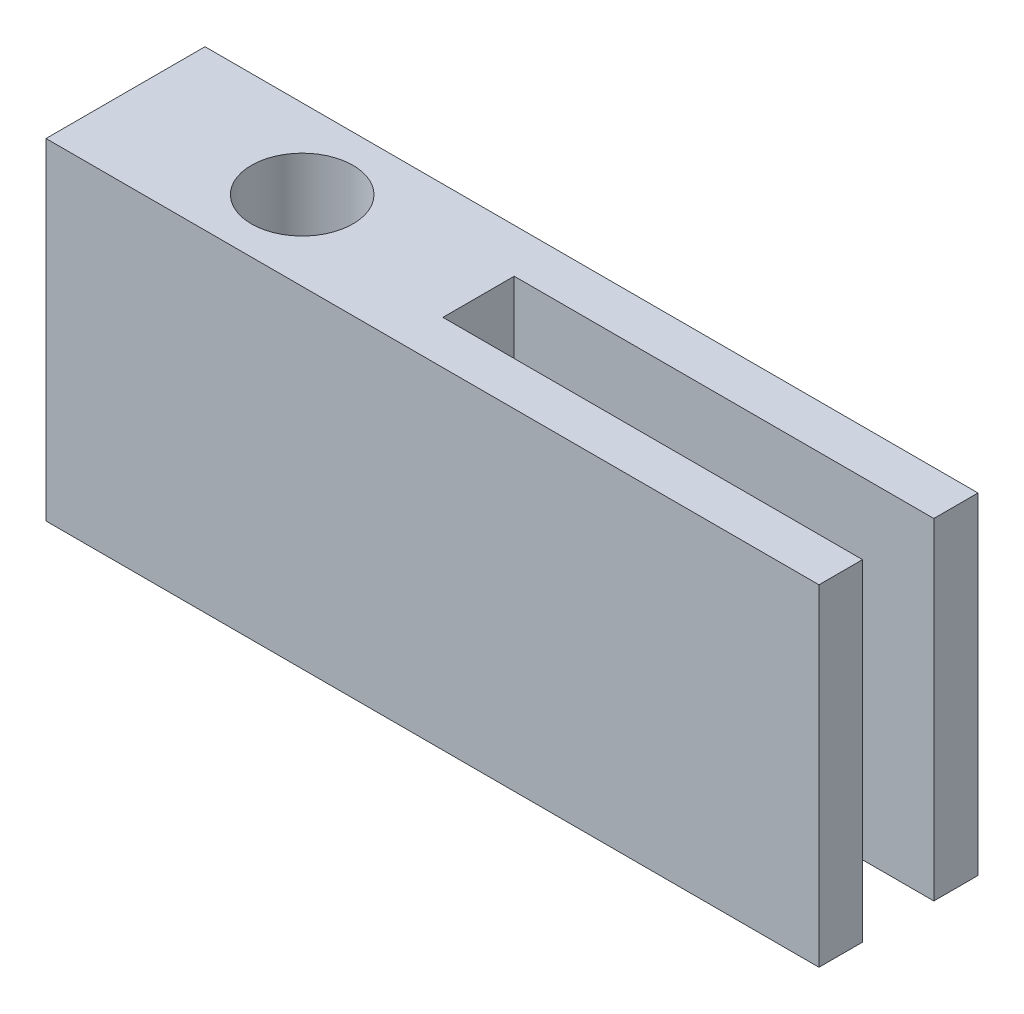
ISO-10303-21;
HEADER;
FILE_DESCRIPTION(('STEP AP214'),'2;1');
FILE_NAME('part.step','',(''),(''),'','','');
FILE_SCHEMA(('AUTOMOTIVE_DESIGN { 1 0 10303 214 1 1 1 1 }'));
ENDSEC;
DATA;
#1=APPLICATION_CONTEXT('core data for automotive mechanical design processes');
#2=APPLICATION_PROTOCOL_DEFINITION('international standard','automotive_design',2000,#1);
#3=PRODUCT_CONTEXT('',#1,'mechanical');
#4=PRODUCT('Part','Part','',(#3));
#5=PRODUCT_RELATED_PRODUCT_CATEGORY('part','',(#4));
#6=PRODUCT_DEFINITION_FORMATION('','',#4);
#7=PRODUCT_DEFINITION_CONTEXT('part definition',#1,'design');
#8=PRODUCT_DEFINITION('design','',#6,#7);
#9=PRODUCT_DEFINITION_SHAPE('','',#8);
#10=(LENGTH_UNIT() NAMED_UNIT(*) SI_UNIT(.MILLI.,.METRE.));
#11=(NAMED_UNIT(*) PLANE_ANGLE_UNIT() SI_UNIT($,.RADIAN.));
#12=(NAMED_UNIT(*) SI_UNIT($,.STERADIAN.) SOLID_ANGLE_UNIT());
#13=UNCERTAINTY_MEASURE_WITH_UNIT(LENGTH_MEASURE(1.E-05),#10,'distance_accuracy_value','');
#14=(GEOMETRIC_REPRESENTATION_CONTEXT(3) GLOBAL_UNCERTAINTY_ASSIGNED_CONTEXT((#13)) GLOBAL_UNIT_ASSIGNED_CONTEXT((#10,
#11,#12)) REPRESENTATION_CONTEXT('',''));
#15=CARTESIAN_POINT('',(0.,0.,0.));
#16=DIRECTION('',(0.,0.,1.));
#17=DIRECTION('',(1.,0.,0.));
#18=AXIS2_PLACEMENT_3D('',#15,#16,#17);
#19=CARTESIAN_POINT('',(0.,7.5,0.));
#20=DIRECTION('',(0.,-1.,0.));
#21=DIRECTION('',(0.,0.,-1.));
#22=AXIS2_PLACEMENT_3D('',#19,#20,#21);
#23=PLANE('',#22);
#24=DIRECTION('',(0.,0.,-1.));
#25=VECTOR('',#24,1.);
#26=CARTESIAN_POINT('',(17.5,7.5,-0.986331657312897));
#27=LINE('',#26,#25);
#28=CARTESIAN_POINT('',(17.5,7.5,0.));
#29=VERTEX_POINT('',#28);
#30=CARTESIAN_POINT('',(17.5,7.5,-0.986331657312897));
#31=VERTEX_POINT('',#30);
#32=EDGE_CURVE('E147',#29,#31,#27,.T.);
#33=ORIENTED_EDGE('',*,*,#32,.T.);
#34=DIRECTION('',(-1.,0.,0.));
#35=VECTOR('',#34,1.);
#36=CARTESIAN_POINT('',(17.5,7.5,-0.986331657312897));
#37=LINE('',#36,#35);
#38=CARTESIAN_POINT('',(8.,7.5,-0.986331657312896));
#39=VERTEX_POINT('',#38);
#40=EDGE_CURVE('E95',#31,#39,#37,.T.);
#41=ORIENTED_EDGE('',*,*,#40,.T.);
#42=DIRECTION('',(0.,0.,-1.));
#43=VECTOR('',#42,1.);
#44=CARTESIAN_POINT('',(8.,7.5,-2.6));
#45=LINE('',#44,#43);
#46=CARTESIAN_POINT('',(8.,7.5,-2.6));
#47=VERTEX_POINT('',#46);
#48=EDGE_CURVE('E162',#39,#47,#45,.T.);
#49=ORIENTED_EDGE('',*,*,#48,.T.);
#50=DIRECTION('',(1.,0.,0.));
#51=VECTOR('',#50,1.);
#52=CARTESIAN_POINT('',(17.5,7.5,-2.6));
#53=LINE('',#52,#51);
#54=CARTESIAN_POINT('',(17.5,7.5,-2.6));
#55=VERTEX_POINT('',#54);
#56=EDGE_CURVE('E175',#47,#55,#53,.T.);
#57=ORIENTED_EDGE('',*,*,#56,.T.);
#58=DIRECTION('',(0.,0.,-1.));
#59=VECTOR('',#58,1.);
#60=CARTESIAN_POINT('',(17.5,7.5,-3.6));
#61=LINE('',#60,#59);
#62=CARTESIAN_POINT('',(17.5,7.5,-3.6));
#63=VERTEX_POINT('',#62);
#64=EDGE_CURVE('E114',#55,#63,#61,.T.);
#65=ORIENTED_EDGE('',*,*,#64,.T.);
#66=DIRECTION('',(-1.,0.,0.));
#67=VECTOR('',#66,1.);
#68=CARTESIAN_POINT('',(17.5,7.5,-3.6));
#69=LINE('',#68,#67);
#70=CARTESIAN_POINT('',(0.,7.5,-3.6));
#71=VERTEX_POINT('',#70);
#72=EDGE_CURVE('E108',#63,#71,#69,.T.);
#73=ORIENTED_EDGE('',*,*,#72,.T.);
#74=DIRECTION('',(0.,0.,1.));
#75=VECTOR('',#74,1.);
#76=CARTESIAN_POINT('',(0.,7.5,-3.6));
#77=LINE('',#76,#75);
#78=CARTESIAN_POINT('',(0.,7.5,0.));
#79=VERTEX_POINT('',#78);
#80=EDGE_CURVE('E112',#71,#79,#77,.T.);
#81=ORIENTED_EDGE('',*,*,#80,.T.);
#82=DIRECTION('',(1.,0.,0.));
#83=VECTOR('',#82,1.);
#84=CARTESIAN_POINT('',(17.5,7.5,0.));
#85=LINE('',#84,#83);
#86=EDGE_CURVE('E52',#79,#29,#85,.T.);
#87=ORIENTED_EDGE('',*,*,#86,.T.);
#88=EDGE_LOOP('',(#33,#41,#49,#57,#65,#73,#81,#87));
#89=FACE_BOUND('',#88,.T.);
#90=CARTESIAN_POINT('',(4.,7.5,-1.8));
#91=DIRECTION('',(0.,1.,0.));
#92=DIRECTION('',(0.,0.,1.));
#93=AXIS2_PLACEMENT_3D('',#90,#91,#92);
#94=CIRCLE('',#93,1.15);
#95=CARTESIAN_POINT('',(4.,7.5,-0.65));
#96=VERTEX_POINT('',#95);
#97=EDGE_CURVE('E136',#96,#96,#94,.T.);
#98=ORIENTED_EDGE('',*,*,#97,.F.);
#99=EDGE_LOOP('',(#98));
#100=FACE_BOUND('',#99,.T.);
#101=ADVANCED_FACE('F35',(#89,#100),#23,.F.);
#102=CARTESIAN_POINT('',(0.,0.,0.));
#103=DIRECTION('',(0.,-1.,0.));
#104=DIRECTION('',(0.,0.,-1.));
#105=AXIS2_PLACEMENT_3D('',#102,#103,#104);
#106=PLANE('',#105);
#107=DIRECTION('',(0.,0.,-1.));
#108=VECTOR('',#107,1.);
#109=CARTESIAN_POINT('',(17.5,0.,-0.986331657312897));
#110=LINE('',#109,#108);
#111=CARTESIAN_POINT('',(17.5,0.,0.));
#112=VERTEX_POINT('',#111);
#113=CARTESIAN_POINT('',(17.5,0.,-0.986331657312897));
#114=VERTEX_POINT('',#113);
#115=EDGE_CURVE('E132',#112,#114,#110,.T.);
#116=ORIENTED_EDGE('',*,*,#115,.F.);
#117=DIRECTION('',(1.,0.,0.));
#118=VECTOR('',#117,1.);
#119=CARTESIAN_POINT('',(17.5,0.,0.));
#120=LINE('',#119,#118);
#121=CARTESIAN_POINT('',(0.,0.,0.));
#122=VERTEX_POINT('',#121);
#123=EDGE_CURVE('E87',#122,#112,#120,.T.);
#124=ORIENTED_EDGE('',*,*,#123,.F.);
#125=DIRECTION('',(0.,0.,1.));
#126=VECTOR('',#125,1.);
#127=CARTESIAN_POINT('',(0.,0.,-3.6));
#128=LINE('',#127,#126);
#129=CARTESIAN_POINT('',(0.,0.,-3.6));
#130=VERTEX_POINT('',#129);
#131=EDGE_CURVE('E81',#130,#122,#128,.T.);
#132=ORIENTED_EDGE('',*,*,#131,.F.);
#133=DIRECTION('',(-1.,0.,0.));
#134=VECTOR('',#133,1.);
#135=CARTESIAN_POINT('',(17.5,0.,-3.6));
#136=LINE('',#135,#134);
#137=CARTESIAN_POINT('',(17.5,0.,-3.6));
#138=VERTEX_POINT('',#137);
#139=EDGE_CURVE('E122',#138,#130,#136,.T.);
#140=ORIENTED_EDGE('',*,*,#139,.F.);
#141=DIRECTION('',(0.,0.,-1.));
#142=VECTOR('',#141,1.);
#143=CARTESIAN_POINT('',(17.5,0.,-3.6));
#144=LINE('',#143,#142);
#145=CARTESIAN_POINT('',(17.5,0.,-2.6));
#146=VERTEX_POINT('',#145);
#147=EDGE_CURVE('E142',#146,#138,#144,.T.);
#148=ORIENTED_EDGE('',*,*,#147,.F.);
#149=DIRECTION('',(1.,0.,0.));
#150=VECTOR('',#149,1.);
#151=CARTESIAN_POINT('',(17.5,0.,-2.6));
#152=LINE('',#151,#150);
#153=CARTESIAN_POINT('',(8.,0.,-2.6));
#154=VERTEX_POINT('',#153);
#155=EDGE_CURVE('E140',#154,#146,#152,.T.);
#156=ORIENTED_EDGE('',*,*,#155,.F.);
#157=DIRECTION('',(0.,0.,-1.));
#158=VECTOR('',#157,1.);
#159=CARTESIAN_POINT('',(8.,0.,-2.6));
#160=LINE('',#159,#158);
#161=CARTESIAN_POINT('',(8.,0.,-0.986331657312896));
#162=VERTEX_POINT('',#161);
#163=EDGE_CURVE('E138',#162,#154,#160,.T.);
#164=ORIENTED_EDGE('',*,*,#163,.F.);
#165=DIRECTION('',(-1.,0.,0.));
#166=VECTOR('',#165,1.);
#167=CARTESIAN_POINT('',(17.5,0.,-0.986331657312897));
#168=LINE('',#167,#166);
#169=EDGE_CURVE('E135',#114,#162,#168,.T.);
#170=ORIENTED_EDGE('',*,*,#169,.F.);
#171=EDGE_LOOP('',(#116,#124,#132,#140,#148,#156,#164,#170));
#172=FACE_BOUND('',#171,.T.);
#173=CARTESIAN_POINT('',(4.,0.,-1.8));
#174=DIRECTION('',(0.,1.,0.));
#175=DIRECTION('',(0.,0.,1.));
#176=AXIS2_PLACEMENT_3D('',#173,#174,#175);
#177=CIRCLE('',#176,1.15);
#178=CARTESIAN_POINT('',(4.,0.,-0.65));
#179=VERTEX_POINT('',#178);
#180=EDGE_CURVE('E181',#179,#179,#177,.T.);
#181=ORIENTED_EDGE('',*,*,#180,.T.);
#182=EDGE_LOOP('',(#181));
#183=FACE_BOUND('',#182,.T.);
#184=ADVANCED_FACE('F166',(#172,#183),#106,.T.);
#185=CARTESIAN_POINT('',(17.5,7.5,-0.986331657312897));
#186=DIRECTION('',(-1.,0.,0.));
#187=DIRECTION('',(0.,0.,1.));
#188=AXIS2_PLACEMENT_3D('',#185,#186,#187);
#189=PLANE('',#188);
#190=ORIENTED_EDGE('',*,*,#115,.T.);
#191=DIRECTION('',(0.,-1.,0.));
#192=VECTOR('',#191,1.);
#193=CARTESIAN_POINT('',(17.5,7.5,-0.986331657312897));
#194=LINE('',#193,#192);
#195=EDGE_CURVE('E11',#31,#114,#194,.T.);
#196=ORIENTED_EDGE('',*,*,#195,.F.);
#197=ORIENTED_EDGE('',*,*,#32,.F.);
#198=DIRECTION('',(0.,-1.,0.));
#199=VECTOR('',#198,1.);
#200=CARTESIAN_POINT('',(17.5,7.5,0.));
#201=LINE('',#200,#199);
#202=EDGE_CURVE('E128',#29,#112,#201,.T.);
#203=ORIENTED_EDGE('',*,*,#202,.T.);
#204=EDGE_LOOP('',(#190,#196,#197,#203));
#205=FACE_BOUND('',#204,.T.);
#206=ADVANCED_FACE('F37',(#205),#189,.F.);
#207=CARTESIAN_POINT('',(17.5,7.5,-0.986331657312897));
#208=DIRECTION('',(0.,0.,1.));
#209=DIRECTION('',(1.,0.,0.));
#210=AXIS2_PLACEMENT_3D('',#207,#208,#209);
#211=PLANE('',#210);
#212=ORIENTED_EDGE('',*,*,#169,.T.);
#213=DIRECTION('',(0.,-1.,0.));
#214=VECTOR('',#213,1.);
#215=CARTESIAN_POINT('',(8.,7.5,-0.986331657312896));
#216=LINE('',#215,#214);
#217=EDGE_CURVE('E44',#39,#162,#216,.T.);
#218=ORIENTED_EDGE('',*,*,#217,.F.);
#219=ORIENTED_EDGE('',*,*,#40,.F.);
#220=ORIENTED_EDGE('',*,*,#195,.T.);
#221=EDGE_LOOP('',(#212,#218,#219,#220));
#222=FACE_BOUND('',#221,.T.);
#223=ADVANCED_FACE('F209',(#222),#211,.F.);
#224=CARTESIAN_POINT('',(8.,7.5,-2.6));
#225=DIRECTION('',(-1.,0.,0.));
#226=DIRECTION('',(0.,0.,1.));
#227=AXIS2_PLACEMENT_3D('',#224,#225,#226);
#228=PLANE('',#227);
#229=ORIENTED_EDGE('',*,*,#163,.T.);
#230=DIRECTION('',(0.,-1.,0.));
#231=VECTOR('',#230,1.);
#232=CARTESIAN_POINT('',(8.,7.5,-2.6));
#233=LINE('',#232,#231);
#234=EDGE_CURVE('E154',#47,#154,#233,.T.);
#235=ORIENTED_EDGE('',*,*,#234,.F.);
#236=ORIENTED_EDGE('',*,*,#48,.F.);
#237=ORIENTED_EDGE('',*,*,#217,.T.);
#238=EDGE_LOOP('',(#229,#235,#236,#237));
#239=FACE_BOUND('',#238,.T.);
#240=ADVANCED_FACE('F160',(#239),#228,.F.);
#241=CARTESIAN_POINT('',(17.5,7.5,-2.6));
#242=DIRECTION('',(0.,0.,-1.));
#243=DIRECTION('',(-1.,0.,0.));
#244=AXIS2_PLACEMENT_3D('',#241,#242,#243);
#245=PLANE('',#244);
#246=ORIENTED_EDGE('',*,*,#155,.T.);
#247=DIRECTION('',(0.,-1.,0.));
#248=VECTOR('',#247,1.);
#249=CARTESIAN_POINT('',(17.5,7.5,-2.6));
#250=LINE('',#249,#248);
#251=EDGE_CURVE('E151',#55,#146,#250,.T.);
#252=ORIENTED_EDGE('',*,*,#251,.F.);
#253=ORIENTED_EDGE('',*,*,#56,.F.);
#254=ORIENTED_EDGE('',*,*,#234,.T.);
#255=EDGE_LOOP('',(#246,#252,#253,#254));
#256=FACE_BOUND('',#255,.T.);
#257=ADVANCED_FACE('F171',(#256),#245,.F.);
#258=CARTESIAN_POINT('',(17.5,7.5,-3.6));
#259=DIRECTION('',(-1.,0.,0.));
#260=DIRECTION('',(0.,0.,1.));
#261=AXIS2_PLACEMENT_3D('',#258,#259,#260);
#262=PLANE('',#261);
#263=ORIENTED_EDGE('',*,*,#147,.T.);
#264=DIRECTION('',(0.,-1.,0.));
#265=VECTOR('',#264,1.);
#266=CARTESIAN_POINT('',(17.5,7.5,-3.6));
#267=LINE('',#266,#265);
#268=EDGE_CURVE('E123',#63,#138,#267,.T.);
#269=ORIENTED_EDGE('',*,*,#268,.F.);
#270=ORIENTED_EDGE('',*,*,#64,.F.);
#271=ORIENTED_EDGE('',*,*,#251,.T.);
#272=EDGE_LOOP('',(#263,#269,#270,#271));
#273=FACE_BOUND('',#272,.T.);
#274=ADVANCED_FACE('F174',(#273),#262,.F.);
#275=CARTESIAN_POINT('',(17.5,7.5,-3.6));
#276=DIRECTION('',(0.,0.,1.));
#277=DIRECTION('',(1.,0.,0.));
#278=AXIS2_PLACEMENT_3D('',#275,#276,#277);
#279=PLANE('',#278);
#280=ORIENTED_EDGE('',*,*,#139,.T.);
#281=DIRECTION('',(0.,-1.,0.));
#282=VECTOR('',#281,1.);
#283=CARTESIAN_POINT('',(0.,7.5,-3.6));
#284=LINE('',#283,#282);
#285=EDGE_CURVE('E119',#71,#130,#284,.T.);
#286=ORIENTED_EDGE('',*,*,#285,.F.);
#287=ORIENTED_EDGE('',*,*,#72,.F.);
#288=ORIENTED_EDGE('',*,*,#268,.T.);
#289=EDGE_LOOP('',(#280,#286,#287,#288));
#290=FACE_BOUND('',#289,.T.);
#291=ADVANCED_FACE('F120',(#290),#279,.F.);
#292=CARTESIAN_POINT('',(0.,7.5,-3.6));
#293=DIRECTION('',(1.,0.,0.));
#294=DIRECTION('',(0.,0.,-1.));
#295=AXIS2_PLACEMENT_3D('',#292,#293,#294);
#296=PLANE('',#295);
#297=ORIENTED_EDGE('',*,*,#131,.T.);
#298=DIRECTION('',(0.,-1.,0.));
#299=VECTOR('',#298,1.);
#300=CARTESIAN_POINT('',(0.,7.5,0.));
#301=LINE('',#300,#299);
#302=EDGE_CURVE('E124',#79,#122,#301,.T.);
#303=ORIENTED_EDGE('',*,*,#302,.F.);
#304=ORIENTED_EDGE('',*,*,#80,.F.);
#305=ORIENTED_EDGE('',*,*,#285,.T.);
#306=EDGE_LOOP('',(#297,#303,#304,#305));
#307=FACE_BOUND('',#306,.T.);
#308=ADVANCED_FACE('F126',(#307),#296,.F.);
#309=CARTESIAN_POINT('',(17.5,7.5,0.));
#310=DIRECTION('',(0.,0.,-1.));
#311=DIRECTION('',(-1.,0.,0.));
#312=AXIS2_PLACEMENT_3D('',#309,#310,#311);
#313=PLANE('',#312);
#314=ORIENTED_EDGE('',*,*,#123,.T.);
#315=ORIENTED_EDGE('',*,*,#202,.F.);
#316=ORIENTED_EDGE('',*,*,#86,.F.);
#317=ORIENTED_EDGE('',*,*,#302,.T.);
#318=EDGE_LOOP('',(#314,#315,#316,#317));
#319=FACE_BOUND('',#318,.T.);
#320=ADVANCED_FACE('F197',(#319),#313,.F.);
#321=CARTESIAN_POINT('',(4.,7.5,-1.8));
#322=DIRECTION('',(0.,-1.,0.));
#323=DIRECTION('',(0.,0.,-1.));
#324=AXIS2_PLACEMENT_3D('',#321,#322,#323);
#325=CYLINDRICAL_SURFACE('',#324,1.15);
#326=ORIENTED_EDGE('',*,*,#97,.T.);
#327=EDGE_LOOP('',(#326));
#328=FACE_BOUND('',#327,.T.);
#329=ORIENTED_EDGE('',*,*,#180,.F.);
#330=EDGE_LOOP('',(#329));
#331=FACE_BOUND('',#330,.T.);
#332=ADVANCED_FACE('F187',(#328,#331),#325,.F.);
#333=CLOSED_SHELL('',(#101,#184,#206,#223,#240,#257,#274,#291,#308,#320,#332));
#334=MANIFOLD_SOLID_BREP('B2',#333);
#335=ADVANCED_BREP_SHAPE_REPRESENTATION('',(#18,#334),#14);
#336=SHAPE_DEFINITION_REPRESENTATION(#9,#335);
ENDSEC;
END-ISO-10303-21;
